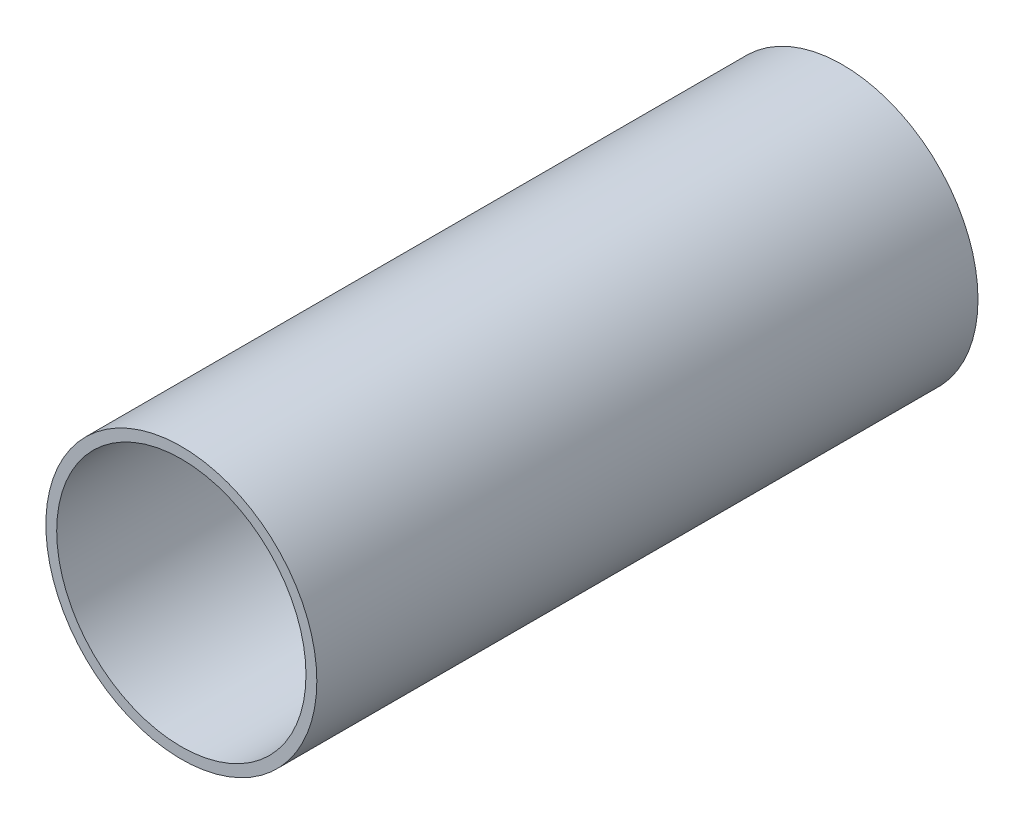
ISO-10303-21;
HEADER;
FILE_DESCRIPTION(('STEP AP214'),'2;1');
FILE_NAME('part.step','',(''),(''),'','','');
FILE_SCHEMA(('AUTOMOTIVE_DESIGN { 1 0 10303 214 1 1 1 1 }'));
ENDSEC;
DATA;
#1=APPLICATION_CONTEXT('core data for automotive mechanical design processes');
#2=APPLICATION_PROTOCOL_DEFINITION('international standard','automotive_design',2000,#1);
#3=PRODUCT_CONTEXT('',#1,'mechanical');
#4=PRODUCT('Part','Part','',(#3));
#5=PRODUCT_RELATED_PRODUCT_CATEGORY('part','',(#4));
#6=PRODUCT_DEFINITION_FORMATION('','',#4);
#7=PRODUCT_DEFINITION_CONTEXT('part definition',#1,'design');
#8=PRODUCT_DEFINITION('design','',#6,#7);
#9=PRODUCT_DEFINITION_SHAPE('','',#8);
#10=(LENGTH_UNIT() NAMED_UNIT(*) SI_UNIT(.MILLI.,.METRE.));
#11=(NAMED_UNIT(*) PLANE_ANGLE_UNIT() SI_UNIT($,.RADIAN.));
#12=(NAMED_UNIT(*) SI_UNIT($,.STERADIAN.) SOLID_ANGLE_UNIT());
#13=UNCERTAINTY_MEASURE_WITH_UNIT(LENGTH_MEASURE(1.E-05),#10,'distance_accuracy_value','');
#14=(GEOMETRIC_REPRESENTATION_CONTEXT(3) GLOBAL_UNCERTAINTY_ASSIGNED_CONTEXT((#13)) GLOBAL_UNIT_ASSIGNED_CONTEXT((#10,
#11,#12)) REPRESENTATION_CONTEXT('',''));
#15=CARTESIAN_POINT('',(0.,0.,0.));
#16=DIRECTION('',(0.,0.,1.));
#17=DIRECTION('',(1.,0.,0.));
#18=AXIS2_PLACEMENT_3D('',#15,#16,#17);
#19=CARTESIAN_POINT('',(0.,0.,-241.3));
#20=DIRECTION('',(0.,0.,1.));
#21=DIRECTION('',(1.,0.,0.));
#22=AXIS2_PLACEMENT_3D('',#19,#20,#21);
#23=CYLINDRICAL_SURFACE('',#22,73.025);
#24=CARTESIAN_POINT('',(0.,0.,-241.3));
#25=DIRECTION('',(0.,0.,1.));
#26=DIRECTION('',(1.,0.,0.));
#27=AXIS2_PLACEMENT_3D('',#24,#25,#26);
#28=CIRCLE('',#27,73.025);
#29=CARTESIAN_POINT('',(73.025,0.,-241.3));
#30=VERTEX_POINT('',#29);
#31=EDGE_CURVE('E39',#30,#30,#28,.T.);
#32=ORIENTED_EDGE('',*,*,#31,.F.);
#33=EDGE_LOOP('',(#32));
#34=FACE_BOUND('',#33,.T.);
#35=CARTESIAN_POINT('',(0.,0.,0.));
#36=DIRECTION('',(0.,0.,1.));
#37=DIRECTION('',(1.,0.,0.));
#38=AXIS2_PLACEMENT_3D('',#35,#36,#37);
#39=CIRCLE('',#38,73.025);
#40=CARTESIAN_POINT('',(73.025,0.,0.));
#41=VERTEX_POINT('',#40);
#42=EDGE_CURVE('E35',#41,#41,#39,.T.);
#43=ORIENTED_EDGE('',*,*,#42,.T.);
#44=EDGE_LOOP('',(#43));
#45=FACE_BOUND('',#44,.T.);
#46=ADVANCED_FACE('F32',(#34,#45),#23,.F.);
#47=CARTESIAN_POINT('',(0.,0.,-241.3));
#48=DIRECTION('',(0.,0.,1.));
#49=DIRECTION('',(1.,0.,0.));
#50=AXIS2_PLACEMENT_3D('',#47,#48,#49);
#51=PLANE('',#50);
#52=ORIENTED_EDGE('',*,*,#31,.T.);
#53=EDGE_LOOP('',(#52));
#54=FACE_BOUND('',#53,.T.);
#55=CARTESIAN_POINT('',(0.,0.,-241.3));
#56=DIRECTION('',(0.,0.,1.));
#57=DIRECTION('',(1.,0.,0.));
#58=AXIS2_PLACEMENT_3D('',#55,#56,#57);
#59=CIRCLE('',#58,76.2);
#60=CARTESIAN_POINT('',(76.2,0.,-241.3));
#61=VERTEX_POINT('',#60);
#62=EDGE_CURVE('E10',#61,#61,#59,.T.);
#63=ORIENTED_EDGE('',*,*,#62,.F.);
#64=EDGE_LOOP('',(#63));
#65=FACE_BOUND('',#64,.T.);
#66=ADVANCED_FACE('F69',(#54,#65),#51,.F.);
#67=CARTESIAN_POINT('',(0.,0.,0.));
#68=DIRECTION('',(0.,0.,1.));
#69=DIRECTION('',(1.,0.,0.));
#70=AXIS2_PLACEMENT_3D('',#67,#68,#69);
#71=PLANE('',#70);
#72=ORIENTED_EDGE('',*,*,#42,.F.);
#73=EDGE_LOOP('',(#72));
#74=FACE_BOUND('',#73,.T.);
#75=CARTESIAN_POINT('',(0.,0.,0.));
#76=DIRECTION('',(0.,0.,1.));
#77=DIRECTION('',(1.,0.,0.));
#78=AXIS2_PLACEMENT_3D('',#75,#76,#77);
#79=CIRCLE('',#78,79.375);
#80=CARTESIAN_POINT('',(79.375,0.,0.));
#81=VERTEX_POINT('',#80);
#82=EDGE_CURVE('E45',#81,#81,#79,.T.);
#83=ORIENTED_EDGE('',*,*,#82,.T.);
#84=EDGE_LOOP('',(#83));
#85=FACE_BOUND('',#84,.T.);
#86=ADVANCED_FACE('F61',(#74,#85),#71,.T.);
#87=CARTESIAN_POINT('',(0.,0.,-387.35));
#88=DIRECTION('',(0.,0.,1.));
#89=DIRECTION('',(1.,0.,0.));
#90=AXIS2_PLACEMENT_3D('',#87,#88,#89);
#91=CYLINDRICAL_SURFACE('',#90,76.2);
#92=CARTESIAN_POINT('',(0.,0.,-387.35));
#93=DIRECTION('',(0.,0.,1.));
#94=DIRECTION('',(1.,0.,0.));
#95=AXIS2_PLACEMENT_3D('',#92,#93,#94);
#96=CIRCLE('',#95,76.2);
#97=CARTESIAN_POINT('',(76.2,0.,-387.35));
#98=VERTEX_POINT('',#97);
#99=EDGE_CURVE('E48',#98,#98,#96,.T.);
#100=ORIENTED_EDGE('',*,*,#99,.F.);
#101=EDGE_LOOP('',(#100));
#102=FACE_BOUND('',#101,.T.);
#103=ORIENTED_EDGE('',*,*,#62,.T.);
#104=EDGE_LOOP('',(#103));
#105=FACE_BOUND('',#104,.T.);
#106=ADVANCED_FACE('F58',(#102,#105),#91,.F.);
#107=CARTESIAN_POINT('',(0.,0.,-387.35));
#108=DIRECTION('',(0.,0.,1.));
#109=DIRECTION('',(1.,0.,0.));
#110=AXIS2_PLACEMENT_3D('',#107,#108,#109);
#111=CYLINDRICAL_SURFACE('',#110,79.375);
#112=CARTESIAN_POINT('',(0.,0.,-387.35));
#113=DIRECTION('',(0.,0.,1.));
#114=DIRECTION('',(1.,0.,0.));
#115=AXIS2_PLACEMENT_3D('',#112,#113,#114);
#116=CIRCLE('',#115,79.375);
#117=CARTESIAN_POINT('',(79.375,0.,-387.35));
#118=VERTEX_POINT('',#117);
#119=EDGE_CURVE('E49',#118,#118,#116,.T.);
#120=ORIENTED_EDGE('',*,*,#119,.T.);
#121=EDGE_LOOP('',(#120));
#122=FACE_BOUND('',#121,.T.);
#123=ORIENTED_EDGE('',*,*,#82,.F.);
#124=EDGE_LOOP('',(#123));
#125=FACE_BOUND('',#124,.T.);
#126=ADVANCED_FACE('F60',(#122,#125),#111,.T.);
#127=CARTESIAN_POINT('',(0.,0.,-387.35));
#128=DIRECTION('',(0.,0.,1.));
#129=DIRECTION('',(1.,0.,0.));
#130=AXIS2_PLACEMENT_3D('',#127,#128,#129);
#131=PLANE('',#130);
#132=ORIENTED_EDGE('',*,*,#99,.T.);
#133=EDGE_LOOP('',(#132));
#134=FACE_BOUND('',#133,.T.);
#135=ORIENTED_EDGE('',*,*,#119,.F.);
#136=EDGE_LOOP('',(#135));
#137=FACE_BOUND('',#136,.T.);
#138=ADVANCED_FACE('F55',(#134,#137),#131,.F.);
#139=CLOSED_SHELL('',(#46,#66,#86,#106,#126,#138));
#140=MANIFOLD_SOLID_BREP('B2',#139);
#141=ADVANCED_BREP_SHAPE_REPRESENTATION('',(#18,#140),#14);
#142=SHAPE_DEFINITION_REPRESENTATION(#9,#141);
ENDSEC;
END-ISO-10303-21;
